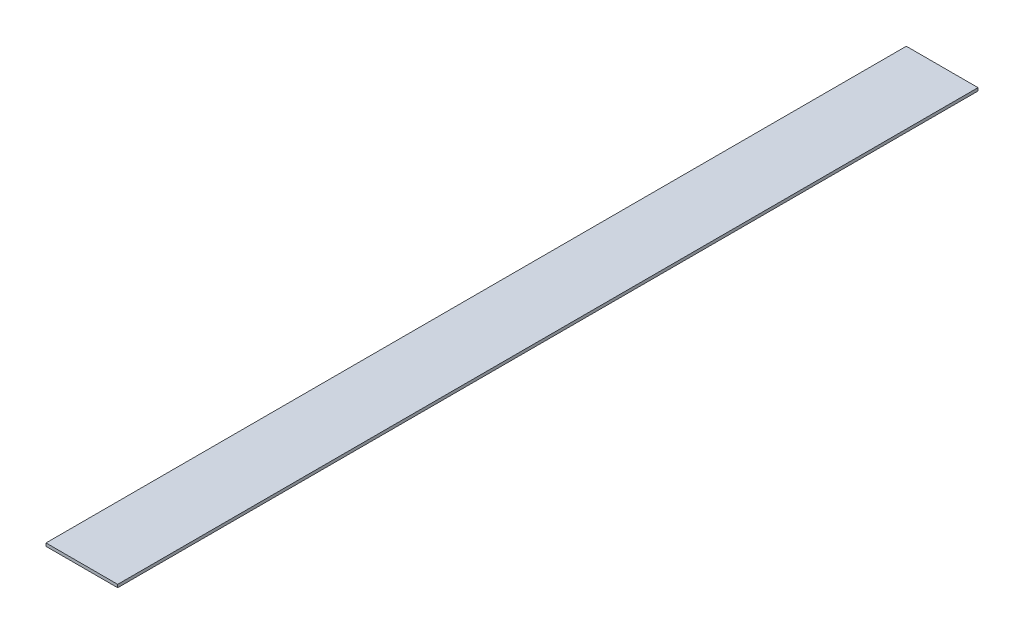
ISO-10303-21;
HEADER;
FILE_DESCRIPTION(('STEP AP214'),'2;1');
FILE_NAME('part.step','',(''),(''),'','','');
FILE_SCHEMA(('AUTOMOTIVE_DESIGN { 1 0 10303 214 1 1 1 1 }'));
ENDSEC;
DATA;
#1=APPLICATION_CONTEXT('core data for automotive mechanical design processes');
#2=APPLICATION_PROTOCOL_DEFINITION('international standard','automotive_design',2000,#1);
#3=PRODUCT_CONTEXT('',#1,'mechanical');
#4=PRODUCT('Part','Part','',(#3));
#5=PRODUCT_RELATED_PRODUCT_CATEGORY('part','',(#4));
#6=PRODUCT_DEFINITION_FORMATION('','',#4);
#7=PRODUCT_DEFINITION_CONTEXT('part definition',#1,'design');
#8=PRODUCT_DEFINITION('design','',#6,#7);
#9=PRODUCT_DEFINITION_SHAPE('','',#8);
#10=(LENGTH_UNIT() NAMED_UNIT(*) SI_UNIT(.MILLI.,.METRE.));
#11=(NAMED_UNIT(*) PLANE_ANGLE_UNIT() SI_UNIT($,.RADIAN.));
#12=(NAMED_UNIT(*) SI_UNIT($,.STERADIAN.) SOLID_ANGLE_UNIT());
#13=UNCERTAINTY_MEASURE_WITH_UNIT(LENGTH_MEASURE(1.E-05),#10,'distance_accuracy_value','');
#14=(GEOMETRIC_REPRESENTATION_CONTEXT(3) GLOBAL_UNCERTAINTY_ASSIGNED_CONTEXT((#13)) GLOBAL_UNIT_ASSIGNED_CONTEXT((#10,
#11,#12)) REPRESENTATION_CONTEXT('',''));
#15=CARTESIAN_POINT('',(0.,0.,0.));
#16=DIRECTION('',(0.,0.,1.));
#17=DIRECTION('',(1.,0.,0.));
#18=AXIS2_PLACEMENT_3D('',#15,#16,#17);
#19=CARTESIAN_POINT('',(0.,3.175,0.));
#20=DIRECTION('',(1.,0.,0.));
#21=DIRECTION('',(0.,0.,-1.));
#22=AXIS2_PLACEMENT_3D('',#19,#20,#21);
#23=PLANE('',#22);
#24=DIRECTION('',(0.,0.,1.));
#25=VECTOR('',#24,1.);
#26=CARTESIAN_POINT('',(0.,0.,0.));
#27=LINE('',#26,#25);
#28=CARTESIAN_POINT('',(0.,0.,-914.4));
#29=VERTEX_POINT('',#28);
#30=CARTESIAN_POINT('',(0.,0.,0.));
#31=VERTEX_POINT('',#30);
#32=EDGE_CURVE('E97',#29,#31,#27,.T.);
#33=ORIENTED_EDGE('',*,*,#32,.T.);
#34=DIRECTION('',(0.,-1.,0.));
#35=VECTOR('',#34,1.);
#36=CARTESIAN_POINT('',(0.,3.175,0.));
#37=LINE('',#36,#35);
#38=CARTESIAN_POINT('',(0.,3.175,0.));
#39=VERTEX_POINT('',#38);
#40=EDGE_CURVE('E11',#39,#31,#37,.T.);
#41=ORIENTED_EDGE('',*,*,#40,.F.);
#42=DIRECTION('',(0.,0.,1.));
#43=VECTOR('',#42,1.);
#44=CARTESIAN_POINT('',(0.,3.175,0.));
#45=LINE('',#44,#43);
#46=CARTESIAN_POINT('',(0.,3.175,-914.4));
#47=VERTEX_POINT('',#46);
#48=EDGE_CURVE('E85',#47,#39,#45,.T.);
#49=ORIENTED_EDGE('',*,*,#48,.F.);
#50=DIRECTION('',(0.,-1.,0.));
#51=VECTOR('',#50,1.);
#52=CARTESIAN_POINT('',(0.,3.175,-914.4));
#53=LINE('',#52,#51);
#54=EDGE_CURVE('E93',#47,#29,#53,.T.);
#55=ORIENTED_EDGE('',*,*,#54,.T.);
#56=EDGE_LOOP('',(#33,#41,#49,#55));
#57=FACE_BOUND('',#56,.T.);
#58=ADVANCED_FACE('F34',(#57),#23,.F.);
#59=CARTESIAN_POINT('',(0.,3.175,0.));
#60=DIRECTION('',(0.,0.,-1.));
#61=DIRECTION('',(-1.,0.,0.));
#62=AXIS2_PLACEMENT_3D('',#59,#60,#61);
#63=PLANE('',#62);
#64=DIRECTION('',(1.,0.,0.));
#65=VECTOR('',#64,1.);
#66=CARTESIAN_POINT('',(0.,0.,0.));
#67=LINE('',#66,#65);
#68=CARTESIAN_POINT('',(76.2,0.,0.));
#69=VERTEX_POINT('',#68);
#70=EDGE_CURVE('E89',#31,#69,#67,.T.);
#71=ORIENTED_EDGE('',*,*,#70,.T.);
#72=DIRECTION('',(0.,-1.,0.));
#73=VECTOR('',#72,1.);
#74=CARTESIAN_POINT('',(76.2,3.175,0.));
#75=LINE('',#74,#73);
#76=CARTESIAN_POINT('',(76.2,3.175,0.));
#77=VERTEX_POINT('',#76);
#78=EDGE_CURVE('E42',#77,#69,#75,.T.);
#79=ORIENTED_EDGE('',*,*,#78,.F.);
#80=DIRECTION('',(1.,0.,0.));
#81=VECTOR('',#80,1.);
#82=CARTESIAN_POINT('',(0.,3.175,0.));
#83=LINE('',#82,#81);
#84=EDGE_CURVE('E80',#39,#77,#83,.T.);
#85=ORIENTED_EDGE('',*,*,#84,.F.);
#86=ORIENTED_EDGE('',*,*,#40,.T.);
#87=EDGE_LOOP('',(#71,#79,#85,#86));
#88=FACE_BOUND('',#87,.T.);
#89=ADVANCED_FACE('F88',(#88),#63,.F.);
#90=CARTESIAN_POINT('',(76.2,3.175,0.));
#91=DIRECTION('',(-1.,0.,0.));
#92=DIRECTION('',(0.,0.,1.));
#93=AXIS2_PLACEMENT_3D('',#90,#91,#92);
#94=PLANE('',#93);
#95=DIRECTION('',(0.,0.,-1.));
#96=VECTOR('',#95,1.);
#97=CARTESIAN_POINT('',(76.2,0.,0.));
#98=LINE('',#97,#96);
#99=CARTESIAN_POINT('',(76.2,0.,-914.4));
#100=VERTEX_POINT('',#99);
#101=EDGE_CURVE('E67',#69,#100,#98,.T.);
#102=ORIENTED_EDGE('',*,*,#101,.T.);
#103=DIRECTION('',(0.,-1.,0.));
#104=VECTOR('',#103,1.);
#105=CARTESIAN_POINT('',(76.2,3.175,-914.4));
#106=LINE('',#105,#104);
#107=CARTESIAN_POINT('',(76.2,3.175,-914.4));
#108=VERTEX_POINT('',#107);
#109=EDGE_CURVE('E90',#108,#100,#106,.T.);
#110=ORIENTED_EDGE('',*,*,#109,.F.);
#111=DIRECTION('',(0.,0.,-1.));
#112=VECTOR('',#111,1.);
#113=CARTESIAN_POINT('',(76.2,3.175,0.));
#114=LINE('',#113,#112);
#115=EDGE_CURVE('E83',#77,#108,#114,.T.);
#116=ORIENTED_EDGE('',*,*,#115,.F.);
#117=ORIENTED_EDGE('',*,*,#78,.T.);
#118=EDGE_LOOP('',(#102,#110,#116,#117));
#119=FACE_BOUND('',#118,.T.);
#120=ADVANCED_FACE('F91',(#119),#94,.F.);
#121=CARTESIAN_POINT('',(0.,3.175,-914.4));
#122=DIRECTION('',(0.,0.,1.));
#123=DIRECTION('',(1.,0.,0.));
#124=AXIS2_PLACEMENT_3D('',#121,#122,#123);
#125=PLANE('',#124);
#126=DIRECTION('',(-1.,0.,0.));
#127=VECTOR('',#126,1.);
#128=CARTESIAN_POINT('',(0.,0.,-914.4));
#129=LINE('',#128,#127);
#130=EDGE_CURVE('E73',#100,#29,#129,.T.);
#131=ORIENTED_EDGE('',*,*,#130,.T.);
#132=ORIENTED_EDGE('',*,*,#54,.F.);
#133=DIRECTION('',(-1.,0.,0.));
#134=VECTOR('',#133,1.);
#135=CARTESIAN_POINT('',(0.,3.175,-914.4));
#136=LINE('',#135,#134);
#137=EDGE_CURVE('E50',#108,#47,#136,.T.);
#138=ORIENTED_EDGE('',*,*,#137,.F.);
#139=ORIENTED_EDGE('',*,*,#109,.T.);
#140=EDGE_LOOP('',(#131,#132,#138,#139));
#141=FACE_BOUND('',#140,.T.);
#142=ADVANCED_FACE('F104',(#141),#125,.F.);
#143=CARTESIAN_POINT('',(0.,3.175,-914.4));
#144=DIRECTION('',(0.,-1.,0.));
#145=DIRECTION('',(0.,0.,-1.));
#146=AXIS2_PLACEMENT_3D('',#143,#144,#145);
#147=PLANE('',#146);
#148=ORIENTED_EDGE('',*,*,#48,.T.);
#149=ORIENTED_EDGE('',*,*,#84,.T.);
#150=ORIENTED_EDGE('',*,*,#115,.T.);
#151=ORIENTED_EDGE('',*,*,#137,.T.);
#152=EDGE_LOOP('',(#148,#149,#150,#151));
#153=FACE_BOUND('',#152,.T.);
#154=ADVANCED_FACE('F81',(#153),#147,.F.);
#155=CARTESIAN_POINT('',(0.,0.,-914.4));
#156=DIRECTION('',(0.,-1.,0.));
#157=DIRECTION('',(0.,0.,-1.));
#158=AXIS2_PLACEMENT_3D('',#155,#156,#157);
#159=PLANE('',#158);
#160=ORIENTED_EDGE('',*,*,#32,.F.);
#161=ORIENTED_EDGE('',*,*,#130,.F.);
#162=ORIENTED_EDGE('',*,*,#101,.F.);
#163=ORIENTED_EDGE('',*,*,#70,.F.);
#164=EDGE_LOOP('',(#160,#161,#162,#163));
#165=FACE_BOUND('',#164,.T.);
#166=ADVANCED_FACE('F107',(#165),#159,.T.);
#167=CLOSED_SHELL('',(#58,#89,#120,#142,#154,#166));
#168=MANIFOLD_SOLID_BREP('B2',#167);
#169=ADVANCED_BREP_SHAPE_REPRESENTATION('',(#18,#168),#14);
#170=SHAPE_DEFINITION_REPRESENTATION(#9,#169);
ENDSEC;
END-ISO-10303-21;
